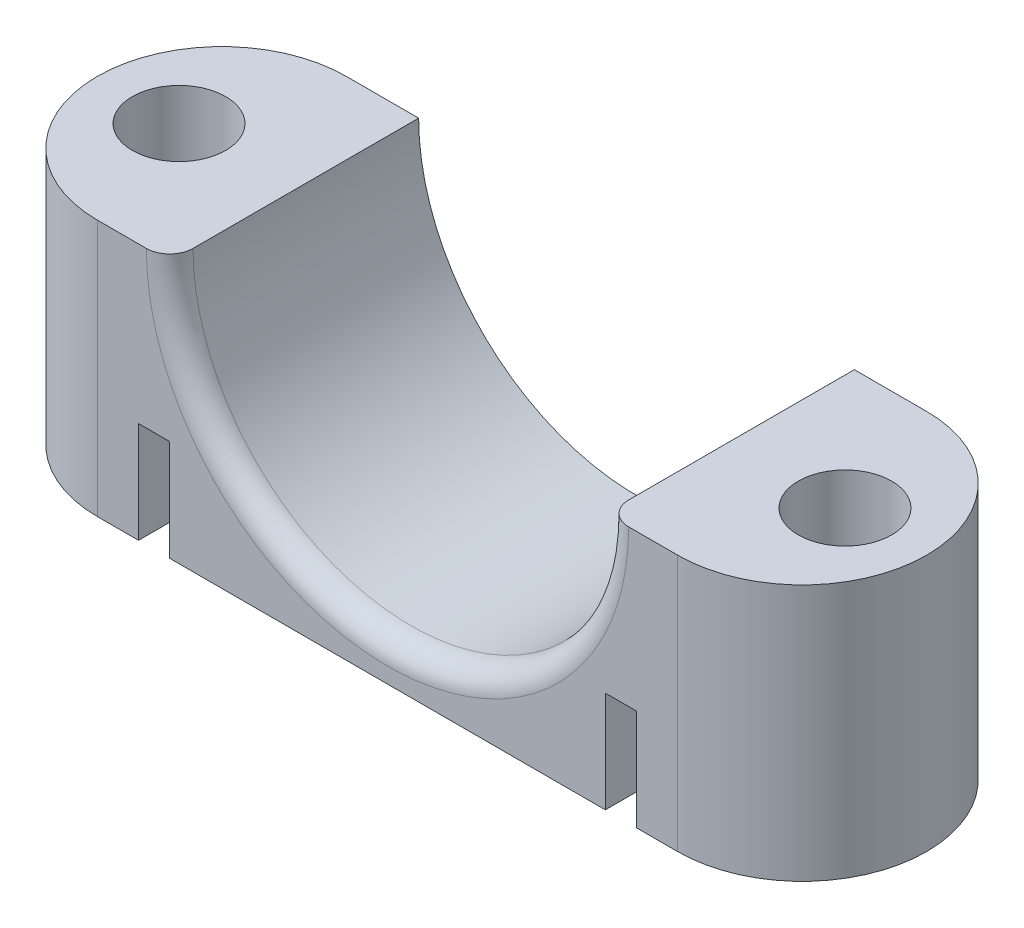
ISO-10303-21;
HEADER;
FILE_DESCRIPTION(('STEP AP214'),'2;1');
FILE_NAME('part.step','',(''),(''),'','','');
FILE_SCHEMA(('AUTOMOTIVE_DESIGN { 1 0 10303 214 1 1 1 1 }'));
ENDSEC;
DATA;
#1=APPLICATION_CONTEXT('core data for automotive mechanical design processes');
#2=APPLICATION_PROTOCOL_DEFINITION('international standard','automotive_design',2000,#1);
#3=PRODUCT_CONTEXT('',#1,'mechanical');
#4=PRODUCT('Part','Part','',(#3));
#5=PRODUCT_RELATED_PRODUCT_CATEGORY('part','',(#4));
#6=PRODUCT_DEFINITION_FORMATION('','',#4);
#7=PRODUCT_DEFINITION_CONTEXT('part definition',#1,'design');
#8=PRODUCT_DEFINITION('design','',#6,#7);
#9=PRODUCT_DEFINITION_SHAPE('','',#8);
#10=(LENGTH_UNIT() NAMED_UNIT(*) SI_UNIT(.MILLI.,.METRE.));
#11=(NAMED_UNIT(*) PLANE_ANGLE_UNIT() SI_UNIT($,.RADIAN.));
#12=(NAMED_UNIT(*) SI_UNIT($,.STERADIAN.) SOLID_ANGLE_UNIT());
#13=UNCERTAINTY_MEASURE_WITH_UNIT(LENGTH_MEASURE(1.E-05),#10,'distance_accuracy_value','');
#14=(GEOMETRIC_REPRESENTATION_CONTEXT(3) GLOBAL_UNCERTAINTY_ASSIGNED_CONTEXT((#13)) GLOBAL_UNIT_ASSIGNED_CONTEXT((#10,
#11,#12)) REPRESENTATION_CONTEXT('',''));
#15=CARTESIAN_POINT('',(0.,0.,0.));
#16=DIRECTION('',(0.,0.,1.));
#17=DIRECTION('',(1.,0.,0.));
#18=AXIS2_PLACEMENT_3D('',#15,#16,#17);
#19=CARTESIAN_POINT('',(21.4,-40.,0.));
#20=DIRECTION('',(0.,1.,0.));
#21=DIRECTION('',(0.,0.,1.));
#22=AXIS2_PLACEMENT_3D('',#19,#20,#21);
#23=CYLINDRICAL_SURFACE('',#22,3.);
#24=CARTESIAN_POINT('',(21.4,0.,0.));
#25=DIRECTION('',(0.,1.,0.));
#26=DIRECTION('',(0.,0.,1.));
#27=AXIS2_PLACEMENT_3D('',#24,#25,#26);
#28=CIRCLE('',#27,3.);
#29=CARTESIAN_POINT('',(21.4,0.,3.));
#30=VERTEX_POINT('',#29);
#31=EDGE_CURVE('E286',#30,#30,#28,.T.);
#32=ORIENTED_EDGE('',*,*,#31,.T.);
#33=EDGE_LOOP('',(#32));
#34=FACE_BOUND('',#33,.T.);
#35=CARTESIAN_POINT('',(21.4,-14.5,0.));
#36=DIRECTION('',(0.,1.,0.));
#37=DIRECTION('',(0.,0.,1.));
#38=AXIS2_PLACEMENT_3D('',#35,#36,#37);
#39=CIRCLE('',#38,3.);
#40=CARTESIAN_POINT('',(21.4,-14.5,3.));
#41=VERTEX_POINT('',#40);
#42=EDGE_CURVE('E189',#41,#41,#39,.T.);
#43=ORIENTED_EDGE('',*,*,#42,.F.);
#44=EDGE_LOOP('',(#43));
#45=FACE_BOUND('',#44,.T.);
#46=ADVANCED_FACE('F68',(#34,#45),#23,.F.);
#47=CARTESIAN_POINT('',(-21.4,-40.,0.));
#48=DIRECTION('',(0.,1.,0.));
#49=DIRECTION('',(0.,0.,1.));
#50=AXIS2_PLACEMENT_3D('',#47,#48,#49);
#51=CYLINDRICAL_SURFACE('',#50,3.);
#52=CARTESIAN_POINT('',(-21.4,0.,0.));
#53=DIRECTION('',(0.,1.,0.));
#54=DIRECTION('',(0.,0.,1.));
#55=AXIS2_PLACEMENT_3D('',#52,#53,#54);
#56=CIRCLE('',#55,3.);
#57=CARTESIAN_POINT('',(-21.4,0.,3.));
#58=VERTEX_POINT('',#57);
#59=EDGE_CURVE('E277',#58,#58,#56,.F.);
#60=ORIENTED_EDGE('',*,*,#59,.F.);
#61=EDGE_LOOP('',(#60));
#62=FACE_BOUND('',#61,.T.);
#63=CARTESIAN_POINT('',(-21.4,-14.5,0.));
#64=DIRECTION('',(0.,1.,0.));
#65=DIRECTION('',(0.,0.,1.));
#66=AXIS2_PLACEMENT_3D('',#63,#64,#65);
#67=CIRCLE('',#66,3.);
#68=CARTESIAN_POINT('',(-21.4,-14.5,3.));
#69=VERTEX_POINT('',#68);
#70=EDGE_CURVE('E187',#69,#69,#67,.T.);
#71=ORIENTED_EDGE('',*,*,#70,.F.);
#72=EDGE_LOOP('',(#71));
#73=FACE_BOUND('',#72,.T.);
#74=ADVANCED_FACE('F334',(#62,#73),#51,.F.);
#75=CARTESIAN_POINT('',(0.,0.,8.));
#76=DIRECTION('',(0.,0.,1.));
#77=DIRECTION('',(1.,0.,0.));
#78=AXIS2_PLACEMENT_3D('',#75,#76,#77);
#79=PLANE('',#78);
#80=DIRECTION('',(-1.,0.,0.));
#81=VECTOR('',#80,1.);
#82=CARTESIAN_POINT('',(0.,-10.,8.));
#83=LINE('',#82,#81);
#84=CARTESIAN_POINT('',(16.,-10.,8.));
#85=VERTEX_POINT('',#84);
#86=CARTESIAN_POINT('',(14.,-10.,8.));
#87=VERTEX_POINT('',#86);
#88=EDGE_CURVE('E257',#85,#87,#83,.T.);
#89=ORIENTED_EDGE('',*,*,#88,.F.);
#90=DIRECTION('',(0.,1.,0.));
#91=VECTOR('',#90,1.);
#92=CARTESIAN_POINT('',(16.,-35.7203668019109,8.));
#93=LINE('',#92,#91);
#94=CARTESIAN_POINT('',(16.,-16.5,8.));
#95=VERTEX_POINT('',#94);
#96=EDGE_CURVE('E209',#95,#85,#93,.T.);
#97=ORIENTED_EDGE('',*,*,#96,.F.);
#98=DIRECTION('',(-1.,0.,0.));
#99=VECTOR('',#98,1.);
#100=CARTESIAN_POINT('',(16.,-16.5,8.));
#101=LINE('',#100,#99);
#102=CARTESIAN_POINT('',(18.65,-16.5,8.));
#103=VERTEX_POINT('',#102);
#104=EDGE_CURVE('E203',#103,#95,#101,.T.);
#105=ORIENTED_EDGE('',*,*,#104,.F.);
#106=DIRECTION('',(0.,1.,0.));
#107=VECTOR('',#106,1.);
#108=CARTESIAN_POINT('',(18.65,-40.,8.));
#109=LINE('',#108,#107);
#110=CARTESIAN_POINT('',(18.65,0.,8.));
#111=VERTEX_POINT('',#110);
#112=EDGE_CURVE('E273',#103,#111,#109,.T.);
#113=ORIENTED_EDGE('',*,*,#112,.T.);
#114=DIRECTION('',(1.,0.,0.));
#115=VECTOR('',#114,1.);
#116=CARTESIAN_POINT('',(0.,0.,8.));
#117=LINE('',#116,#115);
#118=CARTESIAN_POINT('',(15.5,0.,8.));
#119=VERTEX_POINT('',#118);
#120=EDGE_CURVE('E290',#119,#111,#117,.T.);
#121=ORIENTED_EDGE('',*,*,#120,.F.);
#122=CARTESIAN_POINT('',(0.,0.,8.));
#123=DIRECTION('',(0.,0.,1.));
#124=DIRECTION('',(1.,0.,0.));
#125=AXIS2_PLACEMENT_3D('',#122,#123,#124);
#126=CIRCLE('',#125,15.5);
#127=CARTESIAN_POINT('',(-15.5,0.,8.));
#128=VERTEX_POINT('',#127);
#129=EDGE_CURVE('E83',#119,#128,#126,.F.);
#130=ORIENTED_EDGE('',*,*,#129,.T.);
#131=DIRECTION('',(-1.,0.,0.));
#132=VECTOR('',#131,1.);
#133=CARTESIAN_POINT('',(0.,0.,8.));
#134=LINE('',#133,#132);
#135=CARTESIAN_POINT('',(-18.65,0.,7.99999999999999));
#136=VERTEX_POINT('',#135);
#137=EDGE_CURVE('E292',#128,#136,#134,.T.);
#138=ORIENTED_EDGE('',*,*,#137,.T.);
#139=DIRECTION('',(0.,1.,0.));
#140=VECTOR('',#139,1.);
#141=CARTESIAN_POINT('',(-18.65,-40.,7.99999999999999));
#142=LINE('',#141,#140);
#143=CARTESIAN_POINT('',(-18.65,-16.5,8.));
#144=VERTEX_POINT('',#143);
#145=EDGE_CURVE('E281',#144,#136,#142,.T.);
#146=ORIENTED_EDGE('',*,*,#145,.F.);
#147=DIRECTION('',(-1.,0.,0.));
#148=VECTOR('',#147,1.);
#149=CARTESIAN_POINT('',(-16.,-16.5,8.));
#150=LINE('',#149,#148);
#151=CARTESIAN_POINT('',(-16.,-16.5,8.));
#152=VERTEX_POINT('',#151);
#153=EDGE_CURVE('E211',#152,#144,#150,.T.);
#154=ORIENTED_EDGE('',*,*,#153,.F.);
#155=DIRECTION('',(0.,1.,0.));
#156=VECTOR('',#155,1.);
#157=CARTESIAN_POINT('',(-16.,-35.7203668019109,8.));
#158=LINE('',#157,#156);
#159=CARTESIAN_POINT('',(-16.,-10.,8.));
#160=VERTEX_POINT('',#159);
#161=EDGE_CURVE('E223',#152,#160,#158,.T.);
#162=ORIENTED_EDGE('',*,*,#161,.T.);
#163=DIRECTION('',(1.,0.,0.));
#164=VECTOR('',#163,1.);
#165=CARTESIAN_POINT('',(0.,-10.,8.));
#166=LINE('',#165,#164);
#167=CARTESIAN_POINT('',(-14.,-10.,8.));
#168=VERTEX_POINT('',#167);
#169=EDGE_CURVE('E237',#160,#168,#166,.T.);
#170=ORIENTED_EDGE('',*,*,#169,.T.);
#171=DIRECTION('',(0.,-1.,0.));
#172=VECTOR('',#171,1.);
#173=CARTESIAN_POINT('',(-14.,0.,8.));
#174=LINE('',#173,#172);
#175=CARTESIAN_POINT('',(-14.,-16.5,8.));
#176=VERTEX_POINT('',#175);
#177=EDGE_CURVE('E244',#168,#176,#174,.T.);
#178=ORIENTED_EDGE('',*,*,#177,.T.);
#179=DIRECTION('',(-1.,0.,0.));
#180=VECTOR('',#179,1.);
#181=CARTESIAN_POINT('',(0.,-16.5,8.));
#182=LINE('',#181,#180);
#183=CARTESIAN_POINT('',(14.,-16.5,8.));
#184=VERTEX_POINT('',#183);
#185=EDGE_CURVE('E266',#184,#176,#182,.T.);
#186=ORIENTED_EDGE('',*,*,#185,.F.);
#187=DIRECTION('',(0.,-1.,0.));
#188=VECTOR('',#187,1.);
#189=CARTESIAN_POINT('',(14.,0.,8.));
#190=LINE('',#189,#188);
#191=EDGE_CURVE('E264',#87,#184,#190,.T.);
#192=ORIENTED_EDGE('',*,*,#191,.F.);
#193=EDGE_LOOP('',(#89,#97,#105,#113,#121,#130,#138,#146,#154,#162,#170,#178,#186,#192));
#194=FACE_BOUND('',#193,.T.);
#195=ADVANCED_FACE('F340',(#194),#79,.T.);
#196=CARTESIAN_POINT('',(0.,0.,-8.));
#197=DIRECTION('',(0.,0.,1.));
#198=DIRECTION('',(1.,0.,0.));
#199=AXIS2_PLACEMENT_3D('',#196,#197,#198);
#200=PLANE('',#199);
#201=DIRECTION('',(1.,0.,0.));
#202=VECTOR('',#201,1.);
#203=CARTESIAN_POINT('',(0.,-10.,-8.));
#204=LINE('',#203,#202);
#205=CARTESIAN_POINT('',(-16.,-10.,-8.));
#206=VERTEX_POINT('',#205);
#207=CARTESIAN_POINT('',(-14.,-10.,-8.));
#208=VERTEX_POINT('',#207);
#209=EDGE_CURVE('E229',#206,#208,#204,.T.);
#210=ORIENTED_EDGE('',*,*,#209,.F.);
#211=DIRECTION('',(0.,1.,0.));
#212=VECTOR('',#211,1.);
#213=CARTESIAN_POINT('',(-16.,-35.7203668019109,-8.));
#214=LINE('',#213,#212);
#215=CARTESIAN_POINT('',(-16.,-16.5,-8.));
#216=VERTEX_POINT('',#215);
#217=EDGE_CURVE('E226',#216,#206,#214,.T.);
#218=ORIENTED_EDGE('',*,*,#217,.F.);
#219=DIRECTION('',(1.,0.,0.));
#220=VECTOR('',#219,1.);
#221=CARTESIAN_POINT('',(-16.,-16.5,-8.));
#222=LINE('',#221,#220);
#223=CARTESIAN_POINT('',(-18.65,-16.5,-8.));
#224=VERTEX_POINT('',#223);
#225=EDGE_CURVE('E217',#224,#216,#222,.T.);
#226=ORIENTED_EDGE('',*,*,#225,.F.);
#227=DIRECTION('',(0.,1.,0.));
#228=VECTOR('',#227,1.);
#229=CARTESIAN_POINT('',(-18.65,-40.,-8.));
#230=LINE('',#229,#228);
#231=CARTESIAN_POINT('',(-18.65,0.,-8.));
#232=VERTEX_POINT('',#231);
#233=EDGE_CURVE('E274',#224,#232,#230,.T.);
#234=ORIENTED_EDGE('',*,*,#233,.T.);
#235=DIRECTION('',(-1.,0.,0.));
#236=VECTOR('',#235,1.);
#237=CARTESIAN_POINT('',(0.,0.,-8.));
#238=LINE('',#237,#236);
#239=CARTESIAN_POINT('',(-14.,0.,-8.));
#240=VERTEX_POINT('',#239);
#241=EDGE_CURVE('E293',#240,#232,#238,.T.);
#242=ORIENTED_EDGE('',*,*,#241,.F.);
#243=CARTESIAN_POINT('',(0.,0.,-8.));
#244=DIRECTION('',(0.,0.,1.));
#245=DIRECTION('',(1.,0.,0.));
#246=AXIS2_PLACEMENT_3D('',#243,#244,#245);
#247=CIRCLE('',#246,14.);
#248=CARTESIAN_POINT('',(14.,0.,-8.));
#249=VERTEX_POINT('',#248);
#250=EDGE_CURVE('E298',#240,#249,#247,.T.);
#251=ORIENTED_EDGE('',*,*,#250,.T.);
#252=DIRECTION('',(1.,0.,0.));
#253=VECTOR('',#252,1.);
#254=CARTESIAN_POINT('',(0.,0.,-8.));
#255=LINE('',#254,#253);
#256=CARTESIAN_POINT('',(18.65,0.,-8.));
#257=VERTEX_POINT('',#256);
#258=EDGE_CURVE('E289',#249,#257,#255,.T.);
#259=ORIENTED_EDGE('',*,*,#258,.T.);
#260=DIRECTION('',(0.,1.,0.));
#261=VECTOR('',#260,1.);
#262=CARTESIAN_POINT('',(18.65,-40.,-8.));
#263=LINE('',#262,#261);
#264=CARTESIAN_POINT('',(18.65,-16.5,-8.));
#265=VERTEX_POINT('',#264);
#266=EDGE_CURVE('E275',#265,#257,#263,.T.);
#267=ORIENTED_EDGE('',*,*,#266,.F.);
#268=DIRECTION('',(1.,0.,0.));
#269=VECTOR('',#268,1.);
#270=CARTESIAN_POINT('',(16.,-16.5,-8.));
#271=LINE('',#270,#269);
#272=CARTESIAN_POINT('',(16.,-16.5,-8.));
#273=VERTEX_POINT('',#272);
#274=EDGE_CURVE('E197',#273,#265,#271,.T.);
#275=ORIENTED_EDGE('',*,*,#274,.F.);
#276=DIRECTION('',(0.,1.,0.));
#277=VECTOR('',#276,1.);
#278=CARTESIAN_POINT('',(16.,-35.7203668019109,-8.));
#279=LINE('',#278,#277);
#280=CARTESIAN_POINT('',(16.,-10.,-8.));
#281=VERTEX_POINT('',#280);
#282=EDGE_CURVE('E206',#273,#281,#279,.T.);
#283=ORIENTED_EDGE('',*,*,#282,.T.);
#284=DIRECTION('',(-1.,0.,0.));
#285=VECTOR('',#284,1.);
#286=CARTESIAN_POINT('',(0.,-10.,-8.));
#287=LINE('',#286,#285);
#288=CARTESIAN_POINT('',(14.,-10.,-8.));
#289=VERTEX_POINT('',#288);
#290=EDGE_CURVE('E247',#281,#289,#287,.T.);
#291=ORIENTED_EDGE('',*,*,#290,.T.);
#292=DIRECTION('',(0.,-1.,0.));
#293=VECTOR('',#292,1.);
#294=CARTESIAN_POINT('',(14.,0.,-8.));
#295=LINE('',#294,#293);
#296=CARTESIAN_POINT('',(14.,-16.5,-8.));
#297=VERTEX_POINT('',#296);
#298=EDGE_CURVE('E250',#289,#297,#295,.T.);
#299=ORIENTED_EDGE('',*,*,#298,.T.);
#300=DIRECTION('',(1.,0.,0.));
#301=VECTOR('',#300,1.);
#302=CARTESIAN_POINT('',(0.,-16.5,-8.));
#303=LINE('',#302,#301);
#304=CARTESIAN_POINT('',(-14.,-16.5,-8.));
#305=VERTEX_POINT('',#304);
#306=EDGE_CURVE('E12',#305,#297,#303,.T.);
#307=ORIENTED_EDGE('',*,*,#306,.F.);
#308=DIRECTION('',(0.,-1.,0.));
#309=VECTOR('',#308,1.);
#310=CARTESIAN_POINT('',(-14.,0.,-8.));
#311=LINE('',#310,#309);
#312=EDGE_CURVE('E231',#208,#305,#311,.T.);
#313=ORIENTED_EDGE('',*,*,#312,.F.);
#314=EDGE_LOOP('',(#210,#218,#226,#234,#242,#251,#259,#267,#275,#283,#291,#299,#307,#313));
#315=FACE_BOUND('',#314,.T.);
#316=ADVANCED_FACE('F348',(#315),#200,.F.);
#317=CARTESIAN_POINT('',(0.,-16.5,8.));
#318=DIRECTION('',(0.,-1.,0.));
#319=DIRECTION('',(0.,0.,-1.));
#320=AXIS2_PLACEMENT_3D('',#317,#318,#319);
#321=PLANE('',#320);
#322=ORIENTED_EDGE('',*,*,#185,.T.);
#323=DIRECTION('',(0.,0.,1.));
#324=VECTOR('',#323,1.);
#325=CARTESIAN_POINT('',(-14.,-16.5,-8.));
#326=LINE('',#325,#324);
#327=EDGE_CURVE('E238',#305,#176,#326,.T.);
#328=ORIENTED_EDGE('',*,*,#327,.F.);
#329=ORIENTED_EDGE('',*,*,#306,.T.);
#330=DIRECTION('',(0.,0.,1.));
#331=VECTOR('',#330,1.);
#332=CARTESIAN_POINT('',(14.,-16.5,-8.));
#333=LINE('',#332,#331);
#334=EDGE_CURVE('E258',#297,#184,#333,.T.);
#335=ORIENTED_EDGE('',*,*,#334,.T.);
#336=EDGE_LOOP('',(#322,#328,#329,#335));
#337=FACE_BOUND('',#336,.T.);
#338=ADVANCED_FACE('F351',(#337),#321,.T.);
#339=CARTESIAN_POINT('',(-18.65,-40.,0.));
#340=DIRECTION('',(0.,1.,0.));
#341=DIRECTION('',(0.,0.,1.));
#342=AXIS2_PLACEMENT_3D('',#339,#340,#341);
#343=CYLINDRICAL_SURFACE('',#342,8.);
#344=ORIENTED_EDGE('',*,*,#233,.F.);
#345=CARTESIAN_POINT('',(-18.65,-16.5,0.));
#346=DIRECTION('',(0.,-1.,0.));
#347=DIRECTION('',(0.,0.,-1.));
#348=AXIS2_PLACEMENT_3D('',#345,#346,#347);
#349=CIRCLE('',#348,8.);
#350=EDGE_CURVE('E220',#144,#224,#349,.T.);
#351=ORIENTED_EDGE('',*,*,#350,.F.);
#352=ORIENTED_EDGE('',*,*,#145,.T.);
#353=CARTESIAN_POINT('',(-18.65,0.,0.));
#354=DIRECTION('',(0.,1.,0.));
#355=DIRECTION('',(0.,0.,1.));
#356=AXIS2_PLACEMENT_3D('',#353,#354,#355);
#357=CIRCLE('',#356,8.);
#358=EDGE_CURVE('E269',#136,#232,#357,.F.);
#359=ORIENTED_EDGE('',*,*,#358,.T.);
#360=EDGE_LOOP('',(#344,#351,#352,#359));
#361=FACE_BOUND('',#360,.T.);
#362=ADVANCED_FACE('F359',(#361),#343,.T.);
#363=CARTESIAN_POINT('',(0.,0.,8.));
#364=DIRECTION('',(0.,1.,0.));
#365=DIRECTION('',(-1.,0.,0.));
#366=AXIS2_PLACEMENT_3D('',#363,#364,#365);
#367=PLANE('',#366);
#368=ORIENTED_EDGE('',*,*,#31,.F.);
#369=EDGE_LOOP('',(#368));
#370=FACE_BOUND('',#369,.T.);
#371=DIRECTION('',(0.,0.,-1.));
#372=VECTOR('',#371,1.);
#373=CARTESIAN_POINT('',(14.,0.,8.));
#374=LINE('',#373,#372);
#375=CARTESIAN_POINT('',(14.,0.,6.5));
#376=VERTEX_POINT('',#375);
#377=EDGE_CURVE('E304',#376,#249,#374,.T.);
#378=ORIENTED_EDGE('',*,*,#377,.F.);
#379=CARTESIAN_POINT('',(15.5,0.,6.5));
#380=DIRECTION('',(0.,1.,0.));
#381=DIRECTION('',(-1.,0.,0.));
#382=AXIS2_PLACEMENT_3D('',#379,#380,#381);
#383=CIRCLE('',#382,1.5);
#384=EDGE_CURVE('E91',#376,#119,#383,.T.);
#385=ORIENTED_EDGE('',*,*,#384,.T.);
#386=ORIENTED_EDGE('',*,*,#120,.T.);
#387=CARTESIAN_POINT('',(18.65,0.,0.));
#388=DIRECTION('',(0.,1.,0.));
#389=DIRECTION('',(0.,0.,1.));
#390=AXIS2_PLACEMENT_3D('',#387,#388,#389);
#391=CIRCLE('',#390,8.);
#392=EDGE_CURVE('E270',#111,#257,#391,.T.);
#393=ORIENTED_EDGE('',*,*,#392,.T.);
#394=ORIENTED_EDGE('',*,*,#258,.F.);
#395=EDGE_LOOP('',(#378,#385,#386,#393,#394));
#396=FACE_BOUND('',#395,.T.);
#397=ADVANCED_FACE('F355',(#370,#396),#367,.T.);
#398=CARTESIAN_POINT('',(0.,0.,8.));
#399=DIRECTION('',(0.,-1.,0.));
#400=DIRECTION('',(1.,0.,0.));
#401=AXIS2_PLACEMENT_3D('',#398,#399,#400);
#402=PLANE('',#401);
#403=ORIENTED_EDGE('',*,*,#59,.T.);
#404=EDGE_LOOP('',(#403));
#405=FACE_BOUND('',#404,.T.);
#406=ORIENTED_EDGE('',*,*,#137,.F.);
#407=CARTESIAN_POINT('',(-15.5,0.,6.5));
#408=DIRECTION('',(0.,-1.,0.));
#409=DIRECTION('',(1.,0.,0.));
#410=AXIS2_PLACEMENT_3D('',#407,#408,#409);
#411=CIRCLE('',#410,1.5);
#412=CARTESIAN_POINT('',(-14.,0.,6.5));
#413=VERTEX_POINT('',#412);
#414=EDGE_CURVE('E76',#128,#413,#411,.F.);
#415=ORIENTED_EDGE('',*,*,#414,.T.);
#416=DIRECTION('',(0.,0.,-1.));
#417=VECTOR('',#416,1.);
#418=CARTESIAN_POINT('',(-14.,0.,8.));
#419=LINE('',#418,#417);
#420=EDGE_CURVE('E295',#413,#240,#419,.T.);
#421=ORIENTED_EDGE('',*,*,#420,.T.);
#422=ORIENTED_EDGE('',*,*,#241,.T.);
#423=ORIENTED_EDGE('',*,*,#358,.F.);
#424=EDGE_LOOP('',(#406,#415,#421,#422,#423));
#425=FACE_BOUND('',#424,.T.);
#426=ADVANCED_FACE('F313',(#405,#425),#402,.F.);
#427=CARTESIAN_POINT('',(0.,0.,8.));
#428=DIRECTION('',(0.,0.,-1.));
#429=DIRECTION('',(-1.,0.,0.));
#430=AXIS2_PLACEMENT_3D('',#427,#428,#429);
#431=CYLINDRICAL_SURFACE('',#430,14.);
#432=ORIENTED_EDGE('',*,*,#420,.F.);
#433=CARTESIAN_POINT('',(0.,0.,6.5));
#434=DIRECTION('',(0.,0.,1.));
#435=DIRECTION('',(1.,0.,0.));
#436=AXIS2_PLACEMENT_3D('',#433,#434,#435);
#437=CIRCLE('',#436,14.);
#438=EDGE_CURVE('E306',#413,#376,#437,.T.);
#439=ORIENTED_EDGE('',*,*,#438,.T.);
#440=ORIENTED_EDGE('',*,*,#377,.T.);
#441=ORIENTED_EDGE('',*,*,#250,.F.);
#442=EDGE_LOOP('',(#432,#439,#440,#441));
#443=FACE_BOUND('',#442,.T.);
#444=ADVANCED_FACE('F320',(#443),#431,.F.);
#445=CARTESIAN_POINT('',(18.65,-40.,0.));
#446=DIRECTION('',(0.,1.,0.));
#447=DIRECTION('',(0.,0.,1.));
#448=AXIS2_PLACEMENT_3D('',#445,#446,#447);
#449=CYLINDRICAL_SURFACE('',#448,8.);
#450=ORIENTED_EDGE('',*,*,#112,.F.);
#451=CARTESIAN_POINT('',(18.65,-16.5,0.));
#452=DIRECTION('',(0.,-1.,0.));
#453=DIRECTION('',(0.,0.,-1.));
#454=AXIS2_PLACEMENT_3D('',#451,#452,#453);
#455=CIRCLE('',#454,8.);
#456=EDGE_CURVE('E192',#265,#103,#455,.T.);
#457=ORIENTED_EDGE('',*,*,#456,.F.);
#458=ORIENTED_EDGE('',*,*,#266,.T.);
#459=ORIENTED_EDGE('',*,*,#392,.F.);
#460=EDGE_LOOP('',(#450,#457,#458,#459));
#461=FACE_BOUND('',#460,.T.);
#462=ADVANCED_FACE('F323',(#461),#449,.T.);
#463=CARTESIAN_POINT('',(0.,0.,6.5));
#464=DIRECTION('',(0.,0.,1.));
#465=DIRECTION('',(1.,0.,0.));
#466=AXIS2_PLACEMENT_3D('',#463,#464,#465);
#467=TOROIDAL_SURFACE('',#466,15.5,1.5);
#468=ORIENTED_EDGE('',*,*,#414,.F.);
#469=ORIENTED_EDGE('',*,*,#129,.F.);
#470=ORIENTED_EDGE('',*,*,#384,.F.);
#471=ORIENTED_EDGE('',*,*,#438,.F.);
#472=EDGE_LOOP('',(#468,#469,#470,#471));
#473=FACE_BOUND('',#472,.T.);
#474=ADVANCED_FACE('F70',(#473),#467,.T.);
#475=CARTESIAN_POINT('',(0.,-10.,-8.));
#476=DIRECTION('',(0.,1.,0.));
#477=DIRECTION('',(-1.,0.,0.));
#478=AXIS2_PLACEMENT_3D('',#475,#476,#477);
#479=PLANE('',#478);
#480=ORIENTED_EDGE('',*,*,#88,.T.);
#481=DIRECTION('',(0.,0.,1.));
#482=VECTOR('',#481,1.);
#483=CARTESIAN_POINT('',(14.,-10.,-8.));
#484=LINE('',#483,#482);
#485=EDGE_CURVE('E253',#289,#87,#484,.T.);
#486=ORIENTED_EDGE('',*,*,#485,.F.);
#487=ORIENTED_EDGE('',*,*,#290,.F.);
#488=DIRECTION('',(0.,0.,1.));
#489=VECTOR('',#488,1.);
#490=CARTESIAN_POINT('',(16.,-10.,-8.));
#491=LINE('',#490,#489);
#492=EDGE_CURVE('E254',#281,#85,#491,.T.);
#493=ORIENTED_EDGE('',*,*,#492,.T.);
#494=EDGE_LOOP('',(#480,#486,#487,#493));
#495=FACE_BOUND('',#494,.T.);
#496=ADVANCED_FACE('F322',(#495),#479,.F.);
#497=CARTESIAN_POINT('',(14.,0.,-8.));
#498=DIRECTION('',(-1.,0.,0.));
#499=DIRECTION('',(0.,-1.,0.));
#500=AXIS2_PLACEMENT_3D('',#497,#498,#499);
#501=PLANE('',#500);
#502=ORIENTED_EDGE('',*,*,#191,.T.);
#503=ORIENTED_EDGE('',*,*,#334,.F.);
#504=ORIENTED_EDGE('',*,*,#298,.F.);
#505=ORIENTED_EDGE('',*,*,#485,.T.);
#506=EDGE_LOOP('',(#502,#503,#504,#505));
#507=FACE_BOUND('',#506,.T.);
#508=ADVANCED_FACE('F328',(#507),#501,.F.);
#509=CARTESIAN_POINT('',(0.,-10.,-8.));
#510=DIRECTION('',(0.,-1.,0.));
#511=DIRECTION('',(1.,0.,0.));
#512=AXIS2_PLACEMENT_3D('',#509,#510,#511);
#513=PLANE('',#512);
#514=DIRECTION('',(0.,0.,1.));
#515=VECTOR('',#514,1.);
#516=CARTESIAN_POINT('',(-16.,-10.,-8.));
#517=LINE('',#516,#515);
#518=EDGE_CURVE('E233',#206,#160,#517,.T.);
#519=ORIENTED_EDGE('',*,*,#518,.F.);
#520=ORIENTED_EDGE('',*,*,#209,.T.);
#521=DIRECTION('',(0.,0.,1.));
#522=VECTOR('',#521,1.);
#523=CARTESIAN_POINT('',(-14.,-10.,-8.));
#524=LINE('',#523,#522);
#525=EDGE_CURVE('E234',#208,#168,#524,.T.);
#526=ORIENTED_EDGE('',*,*,#525,.T.);
#527=ORIENTED_EDGE('',*,*,#169,.F.);
#528=EDGE_LOOP('',(#519,#520,#526,#527));
#529=FACE_BOUND('',#528,.T.);
#530=ADVANCED_FACE('F409',(#529),#513,.T.);
#531=CARTESIAN_POINT('',(-14.,0.,-8.));
#532=DIRECTION('',(-1.,0.,0.));
#533=DIRECTION('',(0.,-1.,0.));
#534=AXIS2_PLACEMENT_3D('',#531,#532,#533);
#535=PLANE('',#534);
#536=ORIENTED_EDGE('',*,*,#525,.F.);
#537=ORIENTED_EDGE('',*,*,#312,.T.);
#538=ORIENTED_EDGE('',*,*,#327,.T.);
#539=ORIENTED_EDGE('',*,*,#177,.F.);
#540=EDGE_LOOP('',(#536,#537,#538,#539));
#541=FACE_BOUND('',#540,.T.);
#542=ADVANCED_FACE('F405',(#541),#535,.T.);
#543=CARTESIAN_POINT('',(-16.,-35.7203668019109,8.));
#544=DIRECTION('',(-1.,0.,0.));
#545=DIRECTION('',(0.,0.,1.));
#546=AXIS2_PLACEMENT_3D('',#543,#544,#545);
#547=PLANE('',#546);
#548=ORIENTED_EDGE('',*,*,#518,.T.);
#549=ORIENTED_EDGE('',*,*,#161,.F.);
#550=DIRECTION('',(0.,0.,1.));
#551=VECTOR('',#550,1.);
#552=CARTESIAN_POINT('',(-16.,-16.5,8.));
#553=LINE('',#552,#551);
#554=EDGE_CURVE('E214',#216,#152,#553,.T.);
#555=ORIENTED_EDGE('',*,*,#554,.F.);
#556=ORIENTED_EDGE('',*,*,#217,.T.);
#557=EDGE_LOOP('',(#548,#549,#555,#556));
#558=FACE_BOUND('',#557,.T.);
#559=ADVANCED_FACE('F401',(#558),#547,.F.);
#560=CARTESIAN_POINT('',(0.,-16.5,8.));
#561=DIRECTION('',(0.,-1.,0.));
#562=DIRECTION('',(0.,0.,-1.));
#563=AXIS2_PLACEMENT_3D('',#560,#561,#562);
#564=PLANE('',#563);
#565=ORIENTED_EDGE('',*,*,#153,.T.);
#566=ORIENTED_EDGE('',*,*,#350,.T.);
#567=ORIENTED_EDGE('',*,*,#225,.T.);
#568=ORIENTED_EDGE('',*,*,#554,.T.);
#569=EDGE_LOOP('',(#565,#566,#567,#568));
#570=FACE_BOUND('',#569,.T.);
#571=ADVANCED_FACE('F396',(#570),#564,.T.);
#572=CARTESIAN_POINT('',(16.,-35.7203668019109,8.));
#573=DIRECTION('',(1.,0.,0.));
#574=DIRECTION('',(0.,0.,-1.));
#575=AXIS2_PLACEMENT_3D('',#572,#573,#574);
#576=PLANE('',#575);
#577=ORIENTED_EDGE('',*,*,#96,.T.);
#578=ORIENTED_EDGE('',*,*,#492,.F.);
#579=ORIENTED_EDGE('',*,*,#282,.F.);
#580=DIRECTION('',(0.,0.,-1.));
#581=VECTOR('',#580,1.);
#582=CARTESIAN_POINT('',(16.,-16.5,8.));
#583=LINE('',#582,#581);
#584=EDGE_CURVE('E200',#95,#273,#583,.T.);
#585=ORIENTED_EDGE('',*,*,#584,.F.);
#586=EDGE_LOOP('',(#577,#578,#579,#585));
#587=FACE_BOUND('',#586,.T.);
#588=ADVANCED_FACE('F384',(#587),#576,.F.);
#589=CARTESIAN_POINT('',(0.,-16.5,8.));
#590=DIRECTION('',(0.,-1.,0.));
#591=DIRECTION('',(0.,0.,-1.));
#592=AXIS2_PLACEMENT_3D('',#589,#590,#591);
#593=PLANE('',#592);
#594=ORIENTED_EDGE('',*,*,#456,.T.);
#595=ORIENTED_EDGE('',*,*,#104,.T.);
#596=ORIENTED_EDGE('',*,*,#584,.T.);
#597=ORIENTED_EDGE('',*,*,#274,.T.);
#598=EDGE_LOOP('',(#594,#595,#596,#597));
#599=FACE_BOUND('',#598,.T.);
#600=ADVANCED_FACE('F386',(#599),#593,.T.);
#601=CARTESIAN_POINT('',(21.4,-14.5,0.));
#602=DIRECTION('',(0.,1.,0.));
#603=DIRECTION('',(0.,0.,1.));
#604=AXIS2_PLACEMENT_3D('',#601,#602,#603);
#605=CONICAL_SURFACE('',#604,3.,1.02974425867665);
#606=CARTESIAN_POINT('',(21.4,-16.3025818570827,0.));
#607=VERTEX_POINT('',#606);
#608=VERTEX_LOOP('',#607);
#609=FACE_BOUND('',#608,.T.);
#610=ORIENTED_EDGE('',*,*,#42,.T.);
#611=EDGE_LOOP('',(#610));
#612=FACE_BOUND('',#611,.T.);
#613=ADVANCED_FACE('F183',(#609,#612),#605,.F.);
#614=CARTESIAN_POINT('',(-21.4,-14.5,0.));
#615=DIRECTION('',(0.,1.,0.));
#616=DIRECTION('',(0.,0.,1.));
#617=AXIS2_PLACEMENT_3D('',#614,#615,#616);
#618=CONICAL_SURFACE('',#617,3.,1.02974425867665);
#619=CARTESIAN_POINT('',(-21.4,-16.3025818570827,0.));
#620=VERTEX_POINT('',#619);
#621=VERTEX_LOOP('',#620);
#622=FACE_BOUND('',#621,.T.);
#623=ORIENTED_EDGE('',*,*,#70,.T.);
#624=EDGE_LOOP('',(#623));
#625=FACE_BOUND('',#624,.T.);
#626=ADVANCED_FACE('F180',(#622,#625),#618,.F.);
#627=CLOSED_SHELL('',(#46,#74,#195,#316,#338,#362,#397,#426,#444,#462,#474,#496,#508,#530,#542,
#559,#571,#588,#600,#613,#626));
#628=MANIFOLD_SOLID_BREP('B2',#627);
#629=ADVANCED_BREP_SHAPE_REPRESENTATION('',(#18,#628),#14);
#630=SHAPE_DEFINITION_REPRESENTATION(#9,#629);
ENDSEC;
END-ISO-10303-21;
